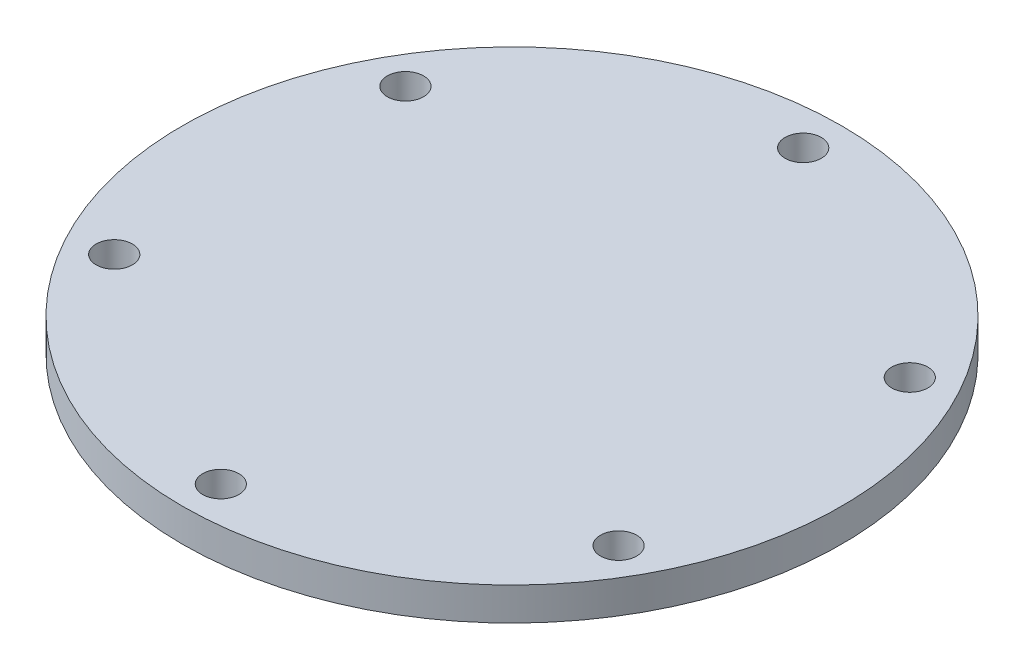
ISO-10303-21;
HEADER;
FILE_DESCRIPTION(('STEP AP214'),'2;1');
FILE_NAME('part.step','',(''),(''),'','','');
FILE_SCHEMA(('AUTOMOTIVE_DESIGN { 1 0 10303 214 1 1 1 1 }'));
ENDSEC;
DATA;
#1=APPLICATION_CONTEXT('core data for automotive mechanical design processes');
#2=APPLICATION_PROTOCOL_DEFINITION('international standard','automotive_design',2000,#1);
#3=PRODUCT_CONTEXT('',#1,'mechanical');
#4=PRODUCT('Part','Part','',(#3));
#5=PRODUCT_RELATED_PRODUCT_CATEGORY('part','',(#4));
#6=PRODUCT_DEFINITION_FORMATION('','',#4);
#7=PRODUCT_DEFINITION_CONTEXT('part definition',#1,'design');
#8=PRODUCT_DEFINITION('design','',#6,#7);
#9=PRODUCT_DEFINITION_SHAPE('','',#8);
#10=(LENGTH_UNIT() NAMED_UNIT(*) SI_UNIT(.MILLI.,.METRE.));
#11=(NAMED_UNIT(*) PLANE_ANGLE_UNIT() SI_UNIT($,.RADIAN.));
#12=(NAMED_UNIT(*) SI_UNIT($,.STERADIAN.) SOLID_ANGLE_UNIT());
#13=UNCERTAINTY_MEASURE_WITH_UNIT(LENGTH_MEASURE(1.E-05),#10,'distance_accuracy_value','');
#14=(GEOMETRIC_REPRESENTATION_CONTEXT(3) GLOBAL_UNCERTAINTY_ASSIGNED_CONTEXT((#13)) GLOBAL_UNIT_ASSIGNED_CONTEXT((#10,
#11,#12)) REPRESENTATION_CONTEXT('',''));
#15=CARTESIAN_POINT('',(0.,0.,0.));
#16=DIRECTION('',(0.,0.,1.));
#17=DIRECTION('',(1.,0.,0.));
#18=AXIS2_PLACEMENT_3D('',#15,#16,#17);
#19=CARTESIAN_POINT('',(0.,0.,0.));
#20=DIRECTION('',(0.,1.,0.));
#21=DIRECTION('',(0.,0.,1.));
#22=AXIS2_PLACEMENT_3D('',#19,#20,#21);
#23=PLANE('',#22);
#24=CARTESIAN_POINT('',(38.2593000930133,0.,22.0890172077074));
#25=DIRECTION('',(0.,-1.,0.));
#26=DIRECTION('',(0.,0.,-1.));
#27=AXIS2_PLACEMENT_3D('',#24,#25,#26);
#28=CIRCLE('',#27,2.75);
#29=CARTESIAN_POINT('',(38.2593000930133,0.,19.3390172077074));
#30=VERTEX_POINT('',#29);
#31=EDGE_CURVE('E131',#30,#30,#28,.T.);
#32=ORIENTED_EDGE('',*,*,#31,.F.);
#33=EDGE_LOOP('',(#32));
#34=FACE_BOUND('',#33,.T.);
#35=CARTESIAN_POINT('',(0.,0.,44.1780344154155));
#36=DIRECTION('',(0.,-1.,0.));
#37=DIRECTION('',(0.,0.,-1.));
#38=AXIS2_PLACEMENT_3D('',#35,#36,#37);
#39=CIRCLE('',#38,2.75);
#40=CARTESIAN_POINT('',(0.,0.,41.4280344154155));
#41=VERTEX_POINT('',#40);
#42=EDGE_CURVE('E96',#41,#41,#39,.T.);
#43=ORIENTED_EDGE('',*,*,#42,.F.);
#44=EDGE_LOOP('',(#43));
#45=FACE_BOUND('',#44,.T.);
#46=CARTESIAN_POINT('',(-38.259300093013,0.,22.0890172077079));
#47=DIRECTION('',(0.,-1.,0.));
#48=DIRECTION('',(0.,0.,-1.));
#49=AXIS2_PLACEMENT_3D('',#46,#47,#48);
#50=CIRCLE('',#49,2.75);
#51=CARTESIAN_POINT('',(-38.259300093013,0.,19.339017207708));
#52=VERTEX_POINT('',#51);
#53=EDGE_CURVE('E95',#52,#52,#50,.T.);
#54=ORIENTED_EDGE('',*,*,#53,.F.);
#55=EDGE_LOOP('',(#54));
#56=FACE_BOUND('',#55,.T.);
#57=CARTESIAN_POINT('',(-38.2593000930131,0.,-22.0890172077077));
#58=DIRECTION('',(0.,-1.,0.));
#59=DIRECTION('',(0.,0.,-1.));
#60=AXIS2_PLACEMENT_3D('',#57,#58,#59);
#61=CIRCLE('',#60,2.75);
#62=CARTESIAN_POINT('',(-38.2593000930131,0.,-24.8390172077077));
#63=VERTEX_POINT('',#62);
#64=EDGE_CURVE('E76',#63,#63,#61,.T.);
#65=ORIENTED_EDGE('',*,*,#64,.F.);
#66=EDGE_LOOP('',(#65));
#67=FACE_BOUND('',#66,.T.);
#68=CARTESIAN_POINT('',(0.,0.,-44.1780344154155));
#69=DIRECTION('',(0.,-1.,0.));
#70=DIRECTION('',(0.,0.,-1.));
#71=AXIS2_PLACEMENT_3D('',#68,#69,#70);
#72=CIRCLE('',#71,2.75);
#73=CARTESIAN_POINT('',(0.,0.,-46.9280344154155));
#74=VERTEX_POINT('',#73);
#75=EDGE_CURVE('E75',#74,#74,#72,.T.);
#76=ORIENTED_EDGE('',*,*,#75,.F.);
#77=EDGE_LOOP('',(#76));
#78=FACE_BOUND('',#77,.T.);
#79=CARTESIAN_POINT('',(0.,0.,0.));
#80=DIRECTION('',(0.,1.,0.));
#81=DIRECTION('',(0.,0.,1.));
#82=AXIS2_PLACEMENT_3D('',#79,#80,#81);
#83=CIRCLE('',#82,50.);
#84=CARTESIAN_POINT('',(0.,0.,50.));
#85=VERTEX_POINT('',#84);
#86=EDGE_CURVE('E48',#85,#85,#83,.T.);
#87=ORIENTED_EDGE('',*,*,#86,.F.);
#88=EDGE_LOOP('',(#87));
#89=FACE_BOUND('',#88,.T.);
#90=CARTESIAN_POINT('',(38.2593000930128,0.,-22.0890172077082));
#91=DIRECTION('',(0.,-1.,0.));
#92=DIRECTION('',(0.,0.,-1.));
#93=AXIS2_PLACEMENT_3D('',#90,#91,#92);
#94=CIRCLE('',#93,2.75);
#95=CARTESIAN_POINT('',(38.2593000930128,0.,-24.8390172077082));
#96=VERTEX_POINT('',#95);
#97=EDGE_CURVE('E124',#96,#96,#94,.T.);
#98=ORIENTED_EDGE('',*,*,#97,.F.);
#99=EDGE_LOOP('',(#98));
#100=FACE_BOUND('',#99,.T.);
#101=ADVANCED_FACE('F44',(#34,#45,#56,#67,#78,#89,#100),#23,.F.);
#102=CARTESIAN_POINT('',(0.,5.,0.));
#103=DIRECTION('',(0.,1.,0.));
#104=DIRECTION('',(0.,0.,1.));
#105=AXIS2_PLACEMENT_3D('',#102,#103,#104);
#106=PLANE('',#105);
#107=CARTESIAN_POINT('',(0.,5.,0.));
#108=DIRECTION('',(0.,1.,0.));
#109=DIRECTION('',(0.,0.,1.));
#110=AXIS2_PLACEMENT_3D('',#107,#108,#109);
#111=CIRCLE('',#110,50.);
#112=CARTESIAN_POINT('',(0.,5.,50.));
#113=VERTEX_POINT('',#112);
#114=EDGE_CURVE('E11',#113,#113,#111,.T.);
#115=ORIENTED_EDGE('',*,*,#114,.T.);
#116=EDGE_LOOP('',(#115));
#117=FACE_BOUND('',#116,.T.);
#118=CARTESIAN_POINT('',(0.,5.,-44.1780344154155));
#119=DIRECTION('',(0.,-1.,0.));
#120=DIRECTION('',(0.,0.,-1.));
#121=AXIS2_PLACEMENT_3D('',#118,#119,#120);
#122=CIRCLE('',#121,2.75);
#123=CARTESIAN_POINT('',(0.,5.,-46.9280344154155));
#124=VERTEX_POINT('',#123);
#125=EDGE_CURVE('E60',#124,#124,#122,.T.);
#126=ORIENTED_EDGE('',*,*,#125,.T.);
#127=EDGE_LOOP('',(#126));
#128=FACE_BOUND('',#127,.T.);
#129=CARTESIAN_POINT('',(-38.2593000930131,5.,-22.0890172077077));
#130=DIRECTION('',(0.,-1.,0.));
#131=DIRECTION('',(0.,0.,-1.));
#132=AXIS2_PLACEMENT_3D('',#129,#130,#131);
#133=CIRCLE('',#132,2.75);
#134=CARTESIAN_POINT('',(-38.2593000930131,5.,-24.8390172077077));
#135=VERTEX_POINT('',#134);
#136=EDGE_CURVE('E71',#135,#135,#133,.T.);
#137=ORIENTED_EDGE('',*,*,#136,.T.);
#138=EDGE_LOOP('',(#137));
#139=FACE_BOUND('',#138,.T.);
#140=CARTESIAN_POINT('',(-38.259300093013,5.,22.0890172077079));
#141=DIRECTION('',(0.,-1.,0.));
#142=DIRECTION('',(0.,0.,-1.));
#143=AXIS2_PLACEMENT_3D('',#140,#141,#142);
#144=CIRCLE('',#143,2.75);
#145=CARTESIAN_POINT('',(-38.259300093013,5.,19.339017207708));
#146=VERTEX_POINT('',#145);
#147=EDGE_CURVE('E102',#146,#146,#144,.T.);
#148=ORIENTED_EDGE('',*,*,#147,.T.);
#149=EDGE_LOOP('',(#148));
#150=FACE_BOUND('',#149,.T.);
#151=CARTESIAN_POINT('',(0.,5.,44.1780344154155));
#152=DIRECTION('',(0.,-1.,0.));
#153=DIRECTION('',(0.,0.,-1.));
#154=AXIS2_PLACEMENT_3D('',#151,#152,#153);
#155=CIRCLE('',#154,2.75);
#156=CARTESIAN_POINT('',(0.,5.,41.4280344154155));
#157=VERTEX_POINT('',#156);
#158=EDGE_CURVE('E90',#157,#157,#155,.T.);
#159=ORIENTED_EDGE('',*,*,#158,.T.);
#160=EDGE_LOOP('',(#159));
#161=FACE_BOUND('',#160,.T.);
#162=CARTESIAN_POINT('',(38.2593000930133,5.,22.0890172077074));
#163=DIRECTION('',(0.,-1.,0.));
#164=DIRECTION('',(0.,0.,-1.));
#165=AXIS2_PLACEMENT_3D('',#162,#163,#164);
#166=CIRCLE('',#165,2.75);
#167=CARTESIAN_POINT('',(38.2593000930133,5.,19.3390172077074));
#168=VERTEX_POINT('',#167);
#169=EDGE_CURVE('E136',#168,#168,#166,.T.);
#170=ORIENTED_EDGE('',*,*,#169,.T.);
#171=EDGE_LOOP('',(#170));
#172=FACE_BOUND('',#171,.T.);
#173=CARTESIAN_POINT('',(38.2593000930128,5.,-22.0890172077082));
#174=DIRECTION('',(0.,-1.,0.));
#175=DIRECTION('',(0.,0.,-1.));
#176=AXIS2_PLACEMENT_3D('',#173,#174,#175);
#177=CIRCLE('',#176,2.75);
#178=CARTESIAN_POINT('',(38.2593000930128,5.,-24.8390172077082));
#179=VERTEX_POINT('',#178);
#180=EDGE_CURVE('E127',#179,#179,#177,.T.);
#181=ORIENTED_EDGE('',*,*,#180,.T.);
#182=EDGE_LOOP('',(#181));
#183=FACE_BOUND('',#182,.T.);
#184=ADVANCED_FACE('F116',(#117,#128,#139,#150,#161,#172,#183),#106,.T.);
#185=CARTESIAN_POINT('',(0.,5.,0.));
#186=DIRECTION('',(0.,-1.,0.));
#187=DIRECTION('',(0.,0.,-1.));
#188=AXIS2_PLACEMENT_3D('',#185,#186,#187);
#189=CYLINDRICAL_SURFACE('',#188,50.);
#190=ORIENTED_EDGE('',*,*,#114,.F.);
#191=EDGE_LOOP('',(#190));
#192=FACE_BOUND('',#191,.T.);
#193=ORIENTED_EDGE('',*,*,#86,.T.);
#194=EDGE_LOOP('',(#193));
#195=FACE_BOUND('',#194,.T.);
#196=ADVANCED_FACE('F46',(#192,#195),#189,.T.);
#197=CARTESIAN_POINT('',(0.,0.,-44.1780344154155));
#198=DIRECTION('',(0.,-1.,0.));
#199=DIRECTION('',(0.,0.,-1.));
#200=AXIS2_PLACEMENT_3D('',#197,#198,#199);
#201=CYLINDRICAL_SURFACE('',#200,2.75);
#202=ORIENTED_EDGE('',*,*,#125,.F.);
#203=EDGE_LOOP('',(#202));
#204=FACE_BOUND('',#203,.T.);
#205=ORIENTED_EDGE('',*,*,#75,.T.);
#206=EDGE_LOOP('',(#205));
#207=FACE_BOUND('',#206,.T.);
#208=ADVANCED_FACE('F163',(#204,#207),#201,.F.);
#209=CARTESIAN_POINT('',(-38.2593000930131,0.,-22.0890172077077));
#210=DIRECTION('',(0.,-1.,0.));
#211=DIRECTION('',(0.,0.,-1.));
#212=AXIS2_PLACEMENT_3D('',#209,#210,#211);
#213=CYLINDRICAL_SURFACE('',#212,2.75);
#214=ORIENTED_EDGE('',*,*,#136,.F.);
#215=EDGE_LOOP('',(#214));
#216=FACE_BOUND('',#215,.T.);
#217=ORIENTED_EDGE('',*,*,#64,.T.);
#218=EDGE_LOOP('',(#217));
#219=FACE_BOUND('',#218,.T.);
#220=ADVANCED_FACE('F112',(#216,#219),#213,.F.);
#221=CARTESIAN_POINT('',(-38.259300093013,0.,22.0890172077079));
#222=DIRECTION('',(0.,-1.,0.));
#223=DIRECTION('',(0.,0.,-1.));
#224=AXIS2_PLACEMENT_3D('',#221,#222,#223);
#225=CYLINDRICAL_SURFACE('',#224,2.75);
#226=ORIENTED_EDGE('',*,*,#147,.F.);
#227=EDGE_LOOP('',(#226));
#228=FACE_BOUND('',#227,.T.);
#229=ORIENTED_EDGE('',*,*,#53,.T.);
#230=EDGE_LOOP('',(#229));
#231=FACE_BOUND('',#230,.T.);
#232=ADVANCED_FACE('F152',(#228,#231),#225,.F.);
#233=CARTESIAN_POINT('',(0.,0.,44.1780344154155));
#234=DIRECTION('',(0.,-1.,0.));
#235=DIRECTION('',(0.,0.,-1.));
#236=AXIS2_PLACEMENT_3D('',#233,#234,#235);
#237=CYLINDRICAL_SURFACE('',#236,2.75);
#238=ORIENTED_EDGE('',*,*,#158,.F.);
#239=EDGE_LOOP('',(#238));
#240=FACE_BOUND('',#239,.T.);
#241=ORIENTED_EDGE('',*,*,#42,.T.);
#242=EDGE_LOOP('',(#241));
#243=FACE_BOUND('',#242,.T.);
#244=ADVANCED_FACE('F154',(#240,#243),#237,.F.);
#245=CARTESIAN_POINT('',(38.2593000930133,0.,22.0890172077074));
#246=DIRECTION('',(0.,-1.,0.));
#247=DIRECTION('',(0.,0.,-1.));
#248=AXIS2_PLACEMENT_3D('',#245,#246,#247);
#249=CYLINDRICAL_SURFACE('',#248,2.75);
#250=ORIENTED_EDGE('',*,*,#169,.F.);
#251=EDGE_LOOP('',(#250));
#252=FACE_BOUND('',#251,.T.);
#253=ORIENTED_EDGE('',*,*,#31,.T.);
#254=EDGE_LOOP('',(#253));
#255=FACE_BOUND('',#254,.T.);
#256=ADVANCED_FACE('F145',(#252,#255),#249,.F.);
#257=CARTESIAN_POINT('',(38.2593000930128,0.,-22.0890172077082));
#258=DIRECTION('',(0.,-1.,0.));
#259=DIRECTION('',(0.,0.,-1.));
#260=AXIS2_PLACEMENT_3D('',#257,#258,#259);
#261=CYLINDRICAL_SURFACE('',#260,2.75);
#262=ORIENTED_EDGE('',*,*,#180,.F.);
#263=EDGE_LOOP('',(#262));
#264=FACE_BOUND('',#263,.T.);
#265=ORIENTED_EDGE('',*,*,#97,.T.);
#266=EDGE_LOOP('',(#265));
#267=FACE_BOUND('',#266,.T.);
#268=ADVANCED_FACE('F187',(#264,#267),#261,.F.);
#269=CLOSED_SHELL('',(#101,#184,#196,#208,#220,#232,#244,#256,#268));
#270=MANIFOLD_SOLID_BREP('B2',#269);
#271=ADVANCED_BREP_SHAPE_REPRESENTATION('',(#18,#270),#14);
#272=SHAPE_DEFINITION_REPRESENTATION(#9,#271);
ENDSEC;
END-ISO-10303-21;
